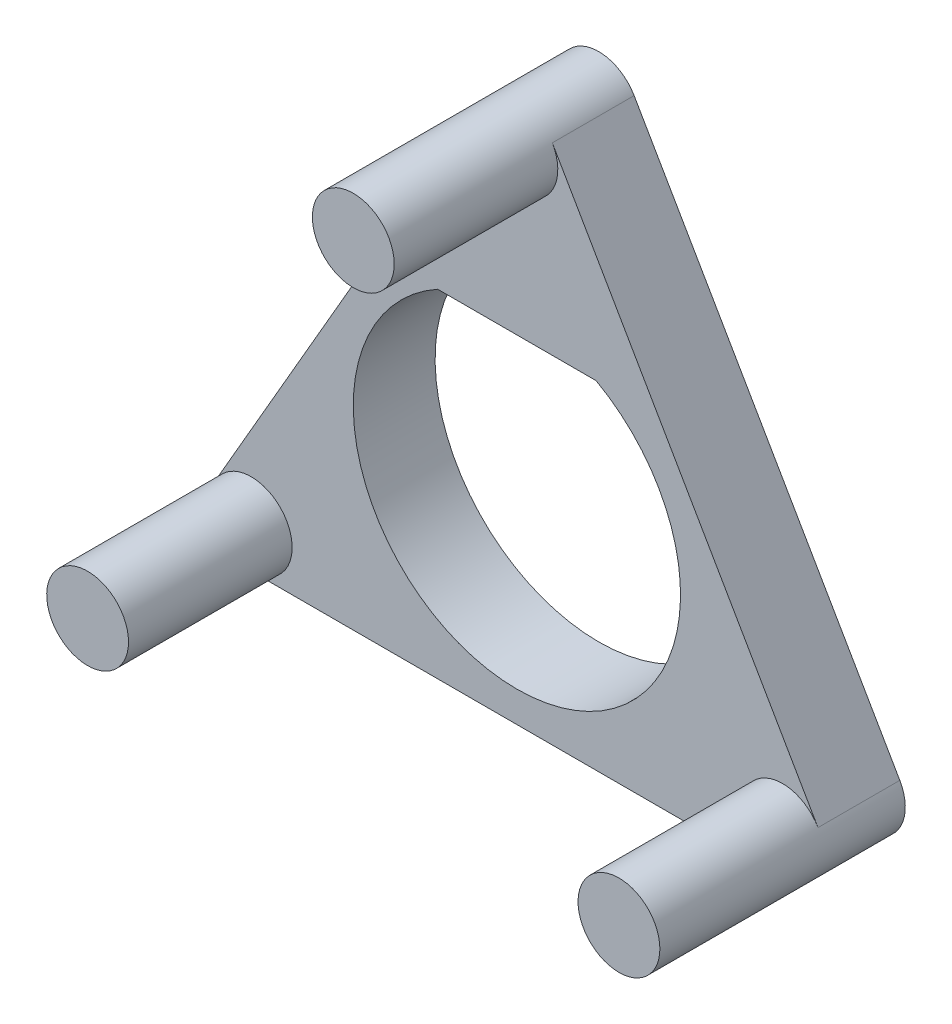
ISO-10303-21;
HEADER;
FILE_DESCRIPTION(('STEP AP214'),'2;1');
FILE_NAME('part.step','',(''),(''),'','','');
FILE_SCHEMA(('AUTOMOTIVE_DESIGN { 1 0 10303 214 1 1 1 1 }'));
ENDSEC;
DATA;
#1=APPLICATION_CONTEXT('core data for automotive mechanical design processes');
#2=APPLICATION_PROTOCOL_DEFINITION('international standard','automotive_design',2000,#1);
#3=PRODUCT_CONTEXT('',#1,'mechanical');
#4=PRODUCT('Part','Part','',(#3));
#5=PRODUCT_RELATED_PRODUCT_CATEGORY('part','',(#4));
#6=PRODUCT_DEFINITION_FORMATION('','',#4);
#7=PRODUCT_DEFINITION_CONTEXT('part definition',#1,'design');
#8=PRODUCT_DEFINITION('design','',#6,#7);
#9=PRODUCT_DEFINITION_SHAPE('','',#8);
#10=(LENGTH_UNIT() NAMED_UNIT(*) SI_UNIT(.MILLI.,.METRE.));
#11=(NAMED_UNIT(*) PLANE_ANGLE_UNIT() SI_UNIT($,.RADIAN.));
#12=(NAMED_UNIT(*) SI_UNIT($,.STERADIAN.) SOLID_ANGLE_UNIT());
#13=UNCERTAINTY_MEASURE_WITH_UNIT(LENGTH_MEASURE(1.E-05),#10,'distance_accuracy_value','');
#14=(GEOMETRIC_REPRESENTATION_CONTEXT(3) GLOBAL_UNCERTAINTY_ASSIGNED_CONTEXT((#13)) GLOBAL_UNIT_ASSIGNED_CONTEXT((#10,
#11,#12)) REPRESENTATION_CONTEXT('',''));
#15=CARTESIAN_POINT('',(0.,0.,0.));
#16=DIRECTION('',(0.,0.,1.));
#17=DIRECTION('',(1.,0.,0.));
#18=AXIS2_PLACEMENT_3D('',#15,#16,#17);
#19=CARTESIAN_POINT('',(6.49519052838365,1.,2.));
#20=DIRECTION('',(0.,0.,-1.));
#21=DIRECTION('',(-1.,0.,0.));
#22=AXIS2_PLACEMENT_3D('',#19,#20,#21);
#23=PLANE('',#22);
#24=CARTESIAN_POINT('',(-6.49519052838365,1.,2.));
#25=DIRECTION('',(0.,0.,-1.));
#26=DIRECTION('',(-1.,0.,0.));
#27=AXIS2_PLACEMENT_3D('',#24,#25,#26);
#28=CIRCLE('',#27,0.999999999999998);
#29=CARTESIAN_POINT('',(-6.49519052838365,0.,2.));
#30=VERTEX_POINT('',#29);
#31=CARTESIAN_POINT('',(-7.36121593216809,1.5,2.));
#32=VERTEX_POINT('',#31);
#33=EDGE_CURVE('E140',#30,#32,#28,.F.);
#34=ORIENTED_EDGE('',*,*,#33,.F.);
#35=DIRECTION('',(1.,0.,0.));
#36=VECTOR('',#35,1.);
#37=CARTESIAN_POINT('',(-6.49519052838365,0.,2.));
#38=LINE('',#37,#36);
#39=CARTESIAN_POINT('',(6.49519052838365,0.,2.));
#40=VERTEX_POINT('',#39);
#41=EDGE_CURVE('E150',#30,#40,#38,.T.);
#42=ORIENTED_EDGE('',*,*,#41,.T.);
#43=CARTESIAN_POINT('',(6.49519052838365,1.,2.));
#44=DIRECTION('',(0.,0.,1.));
#45=DIRECTION('',(1.,0.,0.));
#46=AXIS2_PLACEMENT_3D('',#43,#44,#45);
#47=CIRCLE('',#46,0.999999999999999);
#48=CARTESIAN_POINT('',(7.36121593216809,1.5,2.));
#49=VERTEX_POINT('',#48);
#50=EDGE_CURVE('E123',#49,#40,#47,.T.);
#51=ORIENTED_EDGE('',*,*,#50,.F.);
#52=DIRECTION('',(-0.5,0.866025403784438,0.));
#53=VECTOR('',#52,1.);
#54=CARTESIAN_POINT('',(0.866025403784432,12.7500000000006,2.));
#55=LINE('',#54,#53);
#56=CARTESIAN_POINT('',(0.866025403784434,12.7500000000006,2.));
#57=VERTEX_POINT('',#56);
#58=EDGE_CURVE('E142',#49,#57,#55,.T.);
#59=ORIENTED_EDGE('',*,*,#58,.T.);
#60=CARTESIAN_POINT('',(0.,12.2500000000006,2.));
#61=DIRECTION('',(0.,0.,1.));
#62=DIRECTION('',(1.,0.,0.));
#63=AXIS2_PLACEMENT_3D('',#60,#61,#62);
#64=CIRCLE('',#63,0.999999999999999);
#65=CARTESIAN_POINT('',(-0.866025403784441,12.7500000000006,2.));
#66=VERTEX_POINT('',#65);
#67=EDGE_CURVE('E136',#66,#57,#64,.T.);
#68=ORIENTED_EDGE('',*,*,#67,.F.);
#69=DIRECTION('',(-0.5,-0.866025403784439,0.));
#70=VECTOR('',#69,1.);
#71=CARTESIAN_POINT('',(-7.36121593216809,1.5,2.));
#72=LINE('',#71,#70);
#73=EDGE_CURVE('E146',#66,#32,#72,.T.);
#74=ORIENTED_EDGE('',*,*,#73,.T.);
#75=EDGE_LOOP('',(#34,#42,#51,#59,#68,#74));
#76=FACE_BOUND('',#75,.T.);
#77=DIRECTION('',(1.,0.,0.));
#78=VECTOR('',#77,1.);
#79=CARTESIAN_POINT('',(-1.93649167310371,8.2500000000002,2.));
#80=LINE('',#79,#78);
#81=CARTESIAN_POINT('',(-1.93649167310371,8.2500000000002,2.));
#82=VERTEX_POINT('',#81);
#83=CARTESIAN_POINT('',(1.93649167310371,8.2500000000002,2.));
#84=VERTEX_POINT('',#83);
#85=EDGE_CURVE('E55',#82,#84,#80,.T.);
#86=ORIENTED_EDGE('',*,*,#85,.T.);
#87=CARTESIAN_POINT('',(0.,4.7500000000002,2.));
#88=DIRECTION('',(0.,0.,1.));
#89=DIRECTION('',(1.,0.,0.));
#90=AXIS2_PLACEMENT_3D('',#87,#88,#89);
#91=CIRCLE('',#90,4.);
#92=EDGE_CURVE('E110',#82,#84,#91,.T.);
#93=ORIENTED_EDGE('',*,*,#92,.F.);
#94=EDGE_LOOP('',(#86,#93));
#95=FACE_BOUND('',#94,.T.);
#96=ADVANCED_FACE('F39',(#76,#95),#23,.F.);
#97=CARTESIAN_POINT('',(6.49519052838365,1.,0.));
#98=DIRECTION('',(0.,0.,-1.));
#99=DIRECTION('',(-1.,0.,0.));
#100=AXIS2_PLACEMENT_3D('',#97,#98,#99);
#101=PLANE('',#100);
#102=CARTESIAN_POINT('',(6.49519052838365,1.,0.));
#103=DIRECTION('',(0.,0.,1.));
#104=DIRECTION('',(-1.,0.,0.));
#105=AXIS2_PLACEMENT_3D('',#102,#103,#104);
#106=CIRCLE('',#105,0.999999999999999);
#107=CARTESIAN_POINT('',(6.49519052838365,0.,0.));
#108=VERTEX_POINT('',#107);
#109=CARTESIAN_POINT('',(7.36121593216809,1.5,0.));
#110=VERTEX_POINT('',#109);
#111=EDGE_CURVE('E135',#108,#110,#106,.T.);
#112=ORIENTED_EDGE('',*,*,#111,.F.);
#113=DIRECTION('',(1.,0.,0.));
#114=VECTOR('',#113,1.);
#115=CARTESIAN_POINT('',(-6.49519052838365,0.,0.));
#116=LINE('',#115,#114);
#117=CARTESIAN_POINT('',(-6.49519052838365,0.,0.));
#118=VERTEX_POINT('',#117);
#119=EDGE_CURVE('E147',#118,#108,#116,.T.);
#120=ORIENTED_EDGE('',*,*,#119,.F.);
#121=CARTESIAN_POINT('',(-6.49519052838365,1.,0.));
#122=DIRECTION('',(0.,0.,1.));
#123=DIRECTION('',(-1.,0.,0.));
#124=AXIS2_PLACEMENT_3D('',#121,#122,#123);
#125=CIRCLE('',#124,0.999999999999999);
#126=CARTESIAN_POINT('',(-7.36121593216809,1.5,0.));
#127=VERTEX_POINT('',#126);
#128=EDGE_CURVE('E167',#127,#118,#125,.T.);
#129=ORIENTED_EDGE('',*,*,#128,.F.);
#130=DIRECTION('',(-0.5,-0.866025403784439,0.));
#131=VECTOR('',#130,1.);
#132=CARTESIAN_POINT('',(-7.36121593216809,1.5,0.));
#133=LINE('',#132,#131);
#134=CARTESIAN_POINT('',(-0.866025403784441,12.7500000000006,0.));
#135=VERTEX_POINT('',#134);
#136=EDGE_CURVE('E164',#135,#127,#133,.T.);
#137=ORIENTED_EDGE('',*,*,#136,.F.);
#138=CARTESIAN_POINT('',(0.,12.2500000000006,0.));
#139=DIRECTION('',(0.,0.,1.));
#140=DIRECTION('',(1.,0.,0.));
#141=AXIS2_PLACEMENT_3D('',#138,#139,#140);
#142=CIRCLE('',#141,0.999999999999999);
#143=CARTESIAN_POINT('',(0.866025403784432,12.7500000000006,0.));
#144=VERTEX_POINT('',#143);
#145=EDGE_CURVE('E161',#144,#135,#142,.T.);
#146=ORIENTED_EDGE('',*,*,#145,.F.);
#147=DIRECTION('',(-0.5,0.866025403784438,0.));
#148=VECTOR('',#147,1.);
#149=CARTESIAN_POINT('',(0.866025403784432,12.7500000000006,0.));
#150=LINE('',#149,#148);
#151=EDGE_CURVE('E158',#110,#144,#150,.T.);
#152=ORIENTED_EDGE('',*,*,#151,.F.);
#153=EDGE_LOOP('',(#112,#120,#129,#137,#146,#152));
#154=FACE_BOUND('',#153,.T.);
#155=CARTESIAN_POINT('',(0.,4.7500000000002,0.));
#156=DIRECTION('',(0.,0.,-1.));
#157=DIRECTION('',(-1.,0.,0.));
#158=AXIS2_PLACEMENT_3D('',#155,#156,#157);
#159=CIRCLE('',#158,4.);
#160=CARTESIAN_POINT('',(1.93649167310371,8.2500000000002,0.));
#161=VERTEX_POINT('',#160);
#162=CARTESIAN_POINT('',(-1.93649167310371,8.2500000000002,0.));
#163=VERTEX_POINT('',#162);
#164=EDGE_CURVE('E48',#161,#163,#159,.T.);
#165=ORIENTED_EDGE('',*,*,#164,.F.);
#166=DIRECTION('',(-1.,0.,0.));
#167=VECTOR('',#166,1.);
#168=CARTESIAN_POINT('',(6.49519052838365,8.2500000000002,0.));
#169=LINE('',#168,#167);
#170=EDGE_CURVE('E11',#161,#163,#169,.T.);
#171=ORIENTED_EDGE('',*,*,#170,.T.);
#172=EDGE_LOOP('',(#165,#171));
#173=FACE_BOUND('',#172,.T.);
#174=ADVANCED_FACE('F198',(#154,#173),#101,.T.);
#175=CARTESIAN_POINT('',(6.49519052838365,1.,2.));
#176=DIRECTION('',(0.,0.,-1.));
#177=DIRECTION('',(-1.,0.,0.));
#178=AXIS2_PLACEMENT_3D('',#175,#176,#177);
#179=CYLINDRICAL_SURFACE('',#178,0.999999999999999);
#180=ORIENTED_EDGE('',*,*,#111,.T.);
#181=DIRECTION('',(0.,0.,-1.));
#182=VECTOR('',#181,1.);
#183=CARTESIAN_POINT('',(7.36121593216809,1.5,2.));
#184=LINE('',#183,#182);
#185=EDGE_CURVE('E141',#49,#110,#184,.T.);
#186=ORIENTED_EDGE('',*,*,#185,.F.);
#187=ORIENTED_EDGE('',*,*,#50,.T.);
#188=DIRECTION('',(0.,0.,-1.));
#189=VECTOR('',#188,1.);
#190=CARTESIAN_POINT('',(6.49519052838365,0.,2.));
#191=LINE('',#190,#189);
#192=EDGE_CURVE('E154',#40,#108,#191,.T.);
#193=ORIENTED_EDGE('',*,*,#192,.T.);
#194=EDGE_LOOP('',(#180,#186,#187,#193));
#195=FACE_BOUND('',#194,.T.);
#196=CARTESIAN_POINT('',(6.49519052838365,1.,6.));
#197=DIRECTION('',(0.,0.,1.));
#198=DIRECTION('',(1.,0.,0.));
#199=AXIS2_PLACEMENT_3D('',#196,#197,#198);
#200=CIRCLE('',#199,0.999999999999999);
#201=CARTESIAN_POINT('',(7.49519052838365,1.,6.));
#202=VERTEX_POINT('',#201);
#203=EDGE_CURVE('E124',#202,#202,#200,.T.);
#204=ORIENTED_EDGE('',*,*,#203,.F.);
#205=EDGE_LOOP('',(#204));
#206=FACE_BOUND('',#205,.T.);
#207=ADVANCED_FACE('F41',(#195,#206),#179,.T.);
#208=CARTESIAN_POINT('',(0.866025403784432,12.7500000000006,2.));
#209=DIRECTION('',(-0.866025403784438,-0.5,0.));
#210=DIRECTION('',(0.5,-0.866025403784438,0.));
#211=AXIS2_PLACEMENT_3D('',#208,#209,#210);
#212=PLANE('',#211);
#213=ORIENTED_EDGE('',*,*,#151,.T.);
#214=DIRECTION('',(0.,0.,-1.));
#215=VECTOR('',#214,1.);
#216=CARTESIAN_POINT('',(0.866025403784432,12.7500000000006,2.));
#217=LINE('',#216,#215);
#218=EDGE_CURVE('E187',#57,#144,#217,.T.);
#219=ORIENTED_EDGE('',*,*,#218,.F.);
#220=ORIENTED_EDGE('',*,*,#58,.F.);
#221=ORIENTED_EDGE('',*,*,#185,.T.);
#222=EDGE_LOOP('',(#213,#219,#220,#221));
#223=FACE_BOUND('',#222,.T.);
#224=ADVANCED_FACE('F206',(#223),#212,.F.);
#225=CARTESIAN_POINT('',(0.,12.2500000000006,2.));
#226=DIRECTION('',(0.,0.,-1.));
#227=DIRECTION('',(-1.,0.,0.));
#228=AXIS2_PLACEMENT_3D('',#225,#226,#227);
#229=CYLINDRICAL_SURFACE('',#228,0.999999999999999);
#230=ORIENTED_EDGE('',*,*,#145,.T.);
#231=DIRECTION('',(0.,0.,-1.));
#232=VECTOR('',#231,1.);
#233=CARTESIAN_POINT('',(-0.866025403784441,12.7500000000006,2.));
#234=LINE('',#233,#232);
#235=EDGE_CURVE('E183',#66,#135,#234,.T.);
#236=ORIENTED_EDGE('',*,*,#235,.F.);
#237=ORIENTED_EDGE('',*,*,#67,.T.);
#238=ORIENTED_EDGE('',*,*,#218,.T.);
#239=EDGE_LOOP('',(#230,#236,#237,#238));
#240=FACE_BOUND('',#239,.T.);
#241=CARTESIAN_POINT('',(0.,12.2500000000006,6.));
#242=DIRECTION('',(0.,0.,1.));
#243=DIRECTION('',(1.,0.,0.));
#244=AXIS2_PLACEMENT_3D('',#241,#242,#243);
#245=CIRCLE('',#244,0.999999999999999);
#246=CARTESIAN_POINT('',(0.999999999999995,12.2500000000006,6.));
#247=VERTEX_POINT('',#246);
#248=EDGE_CURVE('E128',#247,#247,#245,.T.);
#249=ORIENTED_EDGE('',*,*,#248,.F.);
#250=EDGE_LOOP('',(#249));
#251=FACE_BOUND('',#250,.T.);
#252=ADVANCED_FACE('F225',(#240,#251),#229,.T.);
#253=CARTESIAN_POINT('',(-7.36121593216809,1.5,2.));
#254=DIRECTION('',(0.866025403784439,-0.5,0.));
#255=DIRECTION('',(0.5,0.866025403784439,0.));
#256=AXIS2_PLACEMENT_3D('',#253,#254,#255);
#257=PLANE('',#256);
#258=ORIENTED_EDGE('',*,*,#136,.T.);
#259=DIRECTION('',(0.,0.,-1.));
#260=VECTOR('',#259,1.);
#261=CARTESIAN_POINT('',(-7.36121593216809,1.5,2.));
#262=LINE('',#261,#260);
#263=EDGE_CURVE('E179',#32,#127,#262,.T.);
#264=ORIENTED_EDGE('',*,*,#263,.F.);
#265=ORIENTED_EDGE('',*,*,#73,.F.);
#266=ORIENTED_EDGE('',*,*,#235,.T.);
#267=EDGE_LOOP('',(#258,#264,#265,#266));
#268=FACE_BOUND('',#267,.T.);
#269=ADVANCED_FACE('F221',(#268),#257,.F.);
#270=CARTESIAN_POINT('',(-6.49519052838365,1.,2.));
#271=DIRECTION('',(0.,0.,-1.));
#272=DIRECTION('',(-1.,0.,0.));
#273=AXIS2_PLACEMENT_3D('',#270,#271,#272);
#274=CYLINDRICAL_SURFACE('',#273,0.999999999999999);
#275=ORIENTED_EDGE('',*,*,#128,.T.);
#276=DIRECTION('',(0.,0.,-1.));
#277=VECTOR('',#276,1.);
#278=CARTESIAN_POINT('',(-6.49519052838365,0.,2.));
#279=LINE('',#278,#277);
#280=EDGE_CURVE('E175',#30,#118,#279,.T.);
#281=ORIENTED_EDGE('',*,*,#280,.F.);
#282=ORIENTED_EDGE('',*,*,#33,.T.);
#283=ORIENTED_EDGE('',*,*,#263,.T.);
#284=EDGE_LOOP('',(#275,#281,#282,#283));
#285=FACE_BOUND('',#284,.T.);
#286=CARTESIAN_POINT('',(-6.49519052838365,1.,6.));
#287=DIRECTION('',(0.,0.,1.));
#288=DIRECTION('',(1.,0.,0.));
#289=AXIS2_PLACEMENT_3D('',#286,#287,#288);
#290=CIRCLE('',#289,0.999999999999998);
#291=CARTESIAN_POINT('',(-5.49519052838365,1.,6.));
#292=VERTEX_POINT('',#291);
#293=EDGE_CURVE('E106',#292,#292,#290,.T.);
#294=ORIENTED_EDGE('',*,*,#293,.F.);
#295=EDGE_LOOP('',(#294));
#296=FACE_BOUND('',#295,.T.);
#297=ADVANCED_FACE('F217',(#285,#296),#274,.T.);
#298=CARTESIAN_POINT('',(-6.49519052838365,0.,2.));
#299=DIRECTION('',(0.,1.,0.));
#300=DIRECTION('',(0.,0.,1.));
#301=AXIS2_PLACEMENT_3D('',#298,#299,#300);
#302=PLANE('',#301);
#303=ORIENTED_EDGE('',*,*,#119,.T.);
#304=ORIENTED_EDGE('',*,*,#192,.F.);
#305=ORIENTED_EDGE('',*,*,#41,.F.);
#306=ORIENTED_EDGE('',*,*,#280,.T.);
#307=EDGE_LOOP('',(#303,#304,#305,#306));
#308=FACE_BOUND('',#307,.T.);
#309=ADVANCED_FACE('F213',(#308),#302,.F.);
#310=CARTESIAN_POINT('',(0.,12.2500000000006,6.));
#311=DIRECTION('',(0.,0.,1.));
#312=DIRECTION('',(1.,0.,0.));
#313=AXIS2_PLACEMENT_3D('',#310,#311,#312);
#314=PLANE('',#313);
#315=ORIENTED_EDGE('',*,*,#248,.T.);
#316=EDGE_LOOP('',(#315));
#317=FACE_BOUND('',#316,.T.);
#318=ADVANCED_FACE('F216',(#317),#314,.T.);
#319=CARTESIAN_POINT('',(6.49519052838365,1.,6.));
#320=DIRECTION('',(0.,0.,1.));
#321=DIRECTION('',(1.,0.,0.));
#322=AXIS2_PLACEMENT_3D('',#319,#320,#321);
#323=PLANE('',#322);
#324=ORIENTED_EDGE('',*,*,#203,.T.);
#325=EDGE_LOOP('',(#324));
#326=FACE_BOUND('',#325,.T.);
#327=ADVANCED_FACE('F249',(#326),#323,.T.);
#328=CARTESIAN_POINT('',(-6.49519052838365,1.,6.));
#329=DIRECTION('',(0.,0.,1.));
#330=DIRECTION('',(1.,0.,0.));
#331=AXIS2_PLACEMENT_3D('',#328,#329,#330);
#332=PLANE('',#331);
#333=ORIENTED_EDGE('',*,*,#293,.T.);
#334=EDGE_LOOP('',(#333));
#335=FACE_BOUND('',#334,.T.);
#336=ADVANCED_FACE('F251',(#335),#332,.T.);
#337=CARTESIAN_POINT('',(-1.93649167310371,8.2500000000002,-3.));
#338=DIRECTION('',(0.,-1.,0.));
#339=DIRECTION('',(0.,0.,-1.));
#340=AXIS2_PLACEMENT_3D('',#337,#338,#339);
#341=PLANE('',#340);
#342=DIRECTION('',(0.,0.,1.));
#343=VECTOR('',#342,1.);
#344=CARTESIAN_POINT('',(1.93649167310371,8.2500000000002,-3.));
#345=LINE('',#344,#343);
#346=EDGE_CURVE('E62',#161,#84,#345,.T.);
#347=ORIENTED_EDGE('',*,*,#346,.T.);
#348=ORIENTED_EDGE('',*,*,#85,.F.);
#349=DIRECTION('',(0.,0.,1.));
#350=VECTOR('',#349,1.);
#351=CARTESIAN_POINT('',(-1.93649167310371,8.2500000000002,-3.));
#352=LINE('',#351,#350);
#353=EDGE_CURVE('E107',#163,#82,#352,.T.);
#354=ORIENTED_EDGE('',*,*,#353,.F.);
#355=ORIENTED_EDGE('',*,*,#170,.F.);
#356=EDGE_LOOP('',(#347,#348,#354,#355));
#357=FACE_BOUND('',#356,.T.);
#358=ADVANCED_FACE('F103',(#357),#341,.T.);
#359=CARTESIAN_POINT('',(0.,4.7500000000002,-3.));
#360=DIRECTION('',(0.,0.,1.));
#361=DIRECTION('',(1.,0.,0.));
#362=AXIS2_PLACEMENT_3D('',#359,#360,#361);
#363=CYLINDRICAL_SURFACE('',#362,4.);
#364=ORIENTED_EDGE('',*,*,#164,.T.);
#365=ORIENTED_EDGE('',*,*,#353,.T.);
#366=ORIENTED_EDGE('',*,*,#92,.T.);
#367=ORIENTED_EDGE('',*,*,#346,.F.);
#368=EDGE_LOOP('',(#364,#365,#366,#367));
#369=FACE_BOUND('',#368,.T.);
#370=ADVANCED_FACE('F111',(#369),#363,.F.);
#371=CLOSED_SHELL('',(#96,#174,#207,#224,#252,#269,#297,#309,#318,#327,#336,#358,#370));
#372=MANIFOLD_SOLID_BREP('B2',#371);
#373=ADVANCED_BREP_SHAPE_REPRESENTATION('',(#18,#372),#14);
#374=SHAPE_DEFINITION_REPRESENTATION(#9,#373);
ENDSEC;
END-ISO-10303-21;
